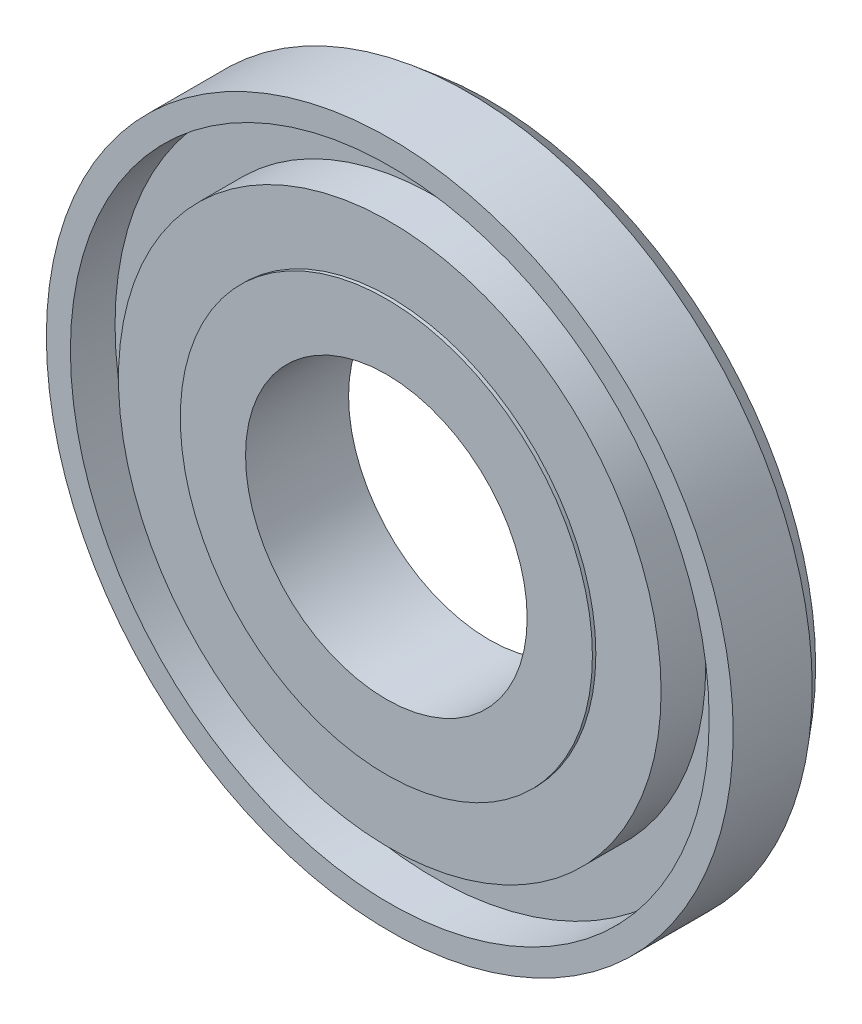
ISO-10303-21;
HEADER;
FILE_DESCRIPTION(('STEP AP214'),'2;1');
FILE_NAME('part.step','',(''),(''),'','','');
FILE_SCHEMA(('AUTOMOTIVE_DESIGN { 1 0 10303 214 1 1 1 1 }'));
ENDSEC;
DATA;
#1=APPLICATION_CONTEXT('core data for automotive mechanical design processes');
#2=APPLICATION_PROTOCOL_DEFINITION('international standard','automotive_design',2000,#1);
#3=PRODUCT_CONTEXT('',#1,'mechanical');
#4=PRODUCT('Part','Part','',(#3));
#5=PRODUCT_RELATED_PRODUCT_CATEGORY('part','',(#4));
#6=PRODUCT_DEFINITION_FORMATION('','',#4);
#7=PRODUCT_DEFINITION_CONTEXT('part definition',#1,'design');
#8=PRODUCT_DEFINITION('design','',#6,#7);
#9=PRODUCT_DEFINITION_SHAPE('','',#8);
#10=(LENGTH_UNIT() NAMED_UNIT(*) SI_UNIT(.MILLI.,.METRE.));
#11=(NAMED_UNIT(*) PLANE_ANGLE_UNIT() SI_UNIT($,.RADIAN.));
#12=(NAMED_UNIT(*) SI_UNIT($,.STERADIAN.) SOLID_ANGLE_UNIT());
#13=UNCERTAINTY_MEASURE_WITH_UNIT(LENGTH_MEASURE(1.E-05),#10,'distance_accuracy_value','');
#14=(GEOMETRIC_REPRESENTATION_CONTEXT(3) GLOBAL_UNCERTAINTY_ASSIGNED_CONTEXT((#13)) GLOBAL_UNIT_ASSIGNED_CONTEXT((#10,
#11,#12)) REPRESENTATION_CONTEXT('',''));
#15=CARTESIAN_POINT('',(0.,0.,0.));
#16=DIRECTION('',(0.,0.,1.));
#17=DIRECTION('',(1.,0.,0.));
#18=AXIS2_PLACEMENT_3D('',#15,#16,#17);
#19=CARTESIAN_POINT('',(2.77555756156289E-13,1.4432899320127E-12,0.));
#20=DIRECTION('',(0.,0.,1.));
#21=DIRECTION('',(1.,0.,0.));
#22=AXIS2_PLACEMENT_3D('',#19,#20,#21);
#23=CYLINDRICAL_SURFACE('',#22,39.5);
#24=CARTESIAN_POINT('',(6.66133814775094E-13,1.22124532708767E-12,7.99999999999368));
#25=DIRECTION('',(0.,0.,1.));
#26=DIRECTION('',(1.,0.,0.));
#27=AXIS2_PLACEMENT_3D('',#24,#25,#26);
#28=CIRCLE('',#27,39.5);
#29=CARTESIAN_POINT('',(39.5000000000007,1.40433498163617E-12,7.99999999999367));
#30=VERTEX_POINT('',#29);
#31=EDGE_CURVE('E91',#30,#30,#28,.T.);
#32=ORIENTED_EDGE('',*,*,#31,.T.);
#33=EDGE_LOOP('',(#32));
#34=FACE_BOUND('',#33,.T.);
#35=CARTESIAN_POINT('',(7.7715611723761E-13,1.33226762955019E-12,14.4999999999939));
#36=DIRECTION('',(0.,0.,1.));
#37=DIRECTION('',(1.,0.,0.));
#38=AXIS2_PLACEMENT_3D('',#35,#36,#37);
#39=CIRCLE('',#38,39.5);
#40=CARTESIAN_POINT('',(39.5000000000008,1.51535728409868E-12,14.4999999999938));
#41=VERTEX_POINT('',#40);
#42=EDGE_CURVE('E10',#41,#41,#39,.T.);
#43=ORIENTED_EDGE('',*,*,#42,.F.);
#44=EDGE_LOOP('',(#43));
#45=FACE_BOUND('',#44,.T.);
#46=ADVANCED_FACE('F40',(#34,#45),#23,.T.);
#47=CARTESIAN_POINT('',(30.0000000000006,7.7715611723761E-13,14.499999999997));
#48=DIRECTION('',(0.,0.,1.));
#49=DIRECTION('',(1.,0.,0.));
#50=AXIS2_PLACEMENT_3D('',#47,#48,#49);
#51=PLANE('',#50);
#52=ORIENTED_EDGE('',*,*,#42,.T.);
#53=EDGE_LOOP('',(#52));
#54=FACE_BOUND('',#53,.T.);
#55=CARTESIAN_POINT('',(7.7715611723761E-13,1.33226762955019E-12,14.4999999999939));
#56=DIRECTION('',(0.,0.,1.));
#57=DIRECTION('',(1.,0.,0.));
#58=AXIS2_PLACEMENT_3D('',#55,#56,#57);
#59=CIRCLE('',#58,30.);
#60=CARTESIAN_POINT('',(30.0000000000007,1.47132306338449E-12,14.4999999999938));
#61=VERTEX_POINT('',#60);
#62=EDGE_CURVE('E47',#61,#61,#59,.T.);
#63=ORIENTED_EDGE('',*,*,#62,.F.);
#64=EDGE_LOOP('',(#63));
#65=FACE_BOUND('',#64,.T.);
#66=ADVANCED_FACE('F112',(#54,#65),#51,.T.);
#67=CARTESIAN_POINT('',(2.77555756156289E-13,1.4432899320127E-12,0.));
#68=DIRECTION('',(0.,0.,1.));
#69=DIRECTION('',(1.,0.,0.));
#70=AXIS2_PLACEMENT_3D('',#67,#68,#69);
#71=CYLINDRICAL_SURFACE('',#70,29.9999999999999);
#72=ORIENTED_EDGE('',*,*,#62,.T.);
#73=EDGE_LOOP('',(#72));
#74=FACE_BOUND('',#73,.T.);
#75=CARTESIAN_POINT('',(6.10622663543836E-13,1.4432899320127E-12,14.999999999994));
#76=DIRECTION('',(0.,0.,1.));
#77=DIRECTION('',(1.,0.,0.));
#78=AXIS2_PLACEMENT_3D('',#75,#76,#77);
#79=CIRCLE('',#78,29.9999999999998);
#80=CARTESIAN_POINT('',(30.0000000000004,1.582345365847E-12,14.999999999994));
#81=VERTEX_POINT('',#80);
#82=EDGE_CURVE('E54',#81,#81,#79,.T.);
#83=ORIENTED_EDGE('',*,*,#82,.F.);
#84=EDGE_LOOP('',(#83));
#85=FACE_BOUND('',#84,.T.);
#86=ADVANCED_FACE('F116',(#74,#85),#71,.T.);
#87=CARTESIAN_POINT('',(20.5000000000001,1.77635683940025E-12,14.9999999999971));
#88=DIRECTION('',(0.,0.,1.));
#89=DIRECTION('',(1.,0.,0.));
#90=AXIS2_PLACEMENT_3D('',#87,#88,#89);
#91=PLANE('',#90);
#92=ORIENTED_EDGE('',*,*,#82,.T.);
#93=EDGE_LOOP('',(#92));
#94=FACE_BOUND('',#93,.T.);
#95=CARTESIAN_POINT('',(6.10622663543836E-13,1.4432899320127E-12,14.999999999994));
#96=DIRECTION('',(0.,0.,1.));
#97=DIRECTION('',(1.,0.,0.));
#98=AXIS2_PLACEMENT_3D('',#95,#96,#97);
#99=CIRCLE('',#98,20.4999999999998);
#100=CARTESIAN_POINT('',(20.5000000000004,1.53831114513281E-12,14.999999999994));
#101=VERTEX_POINT('',#100);
#102=EDGE_CURVE('E61',#101,#101,#99,.T.);
#103=ORIENTED_EDGE('',*,*,#102,.F.);
#104=EDGE_LOOP('',(#103));
#105=FACE_BOUND('',#104,.T.);
#106=ADVANCED_FACE('F120',(#94,#105),#91,.T.);
#107=CARTESIAN_POINT('',(2.77555756156289E-13,1.4432899320127E-12,0.));
#108=DIRECTION('',(0.,0.,1.));
#109=DIRECTION('',(1.,0.,0.));
#110=AXIS2_PLACEMENT_3D('',#107,#108,#109);
#111=CYLINDRICAL_SURFACE('',#110,20.4999999999998);
#112=ORIENTED_EDGE('',*,*,#102,.T.);
#113=EDGE_LOOP('',(#112));
#114=FACE_BOUND('',#113,.T.);
#115=CARTESIAN_POINT('',(2.77555756156289E-13,1.4432899320127E-12,0.));
#116=DIRECTION('',(0.,0.,1.));
#117=DIRECTION('',(1.,0.,0.));
#118=AXIS2_PLACEMENT_3D('',#115,#116,#117);
#119=CIRCLE('',#118,20.4999999999998);
#120=CARTESIAN_POINT('',(20.5000000000001,1.53831114513281E-12,0.));
#121=VERTEX_POINT('',#120);
#122=EDGE_CURVE('E67',#121,#121,#119,.T.);
#123=ORIENTED_EDGE('',*,*,#122,.F.);
#124=EDGE_LOOP('',(#123));
#125=FACE_BOUND('',#124,.T.);
#126=ADVANCED_FACE('F126',(#114,#125),#111,.F.);
#127=CARTESIAN_POINT('',(47.4999999999999,2.22044604925031E-13,0.));
#128=DIRECTION('',(0.,0.,-1.));
#129=DIRECTION('',(-1.,0.,0.));
#130=AXIS2_PLACEMENT_3D('',#127,#128,#129);
#131=PLANE('',#130);
#132=ORIENTED_EDGE('',*,*,#122,.T.);
#133=EDGE_LOOP('',(#132));
#134=FACE_BOUND('',#133,.T.);
#135=CARTESIAN_POINT('',(2.77555756156289E-13,1.4432899320127E-12,0.));
#136=DIRECTION('',(0.,0.,1.));
#137=DIRECTION('',(1.,0.,0.));
#138=AXIS2_PLACEMENT_3D('',#135,#136,#137);
#139=CIRCLE('',#138,47.4999999999998);
#140=CARTESIAN_POINT('',(47.5000000000001,1.66346103558368E-12,0.));
#141=VERTEX_POINT('',#140);
#142=EDGE_CURVE('E71',#141,#141,#139,.T.);
#143=ORIENTED_EDGE('',*,*,#142,.F.);
#144=EDGE_LOOP('',(#143));
#145=FACE_BOUND('',#144,.T.);
#146=ADVANCED_FACE('F130',(#134,#145),#131,.T.);
#147=CARTESIAN_POINT('',(6.66133814775094E-13,1.33226762955019E-12,3.00000000000045));
#148=DIRECTION('',(0.,0.,1.));
#149=DIRECTION('',(1.,0.,0.));
#150=AXIS2_PLACEMENT_3D('',#147,#148,#149);
#151=CONICAL_SURFACE('',#150,49.9999999999997,0.694738276196624);
#152=ORIENTED_EDGE('',*,*,#142,.T.);
#153=EDGE_LOOP('',(#152));
#154=FACE_BOUND('',#153,.T.);
#155=CARTESIAN_POINT('',(6.66133814775094E-13,1.33226762955019E-12,3.00000000000045));
#156=DIRECTION('',(0.,0.,1.));
#157=DIRECTION('',(1.,0.,0.));
#158=AXIS2_PLACEMENT_3D('',#155,#156,#157);
#159=CIRCLE('',#158,49.9999999999997);
#160=CARTESIAN_POINT('',(50.0000000000004,1.56402668594069E-12,3.00000000000044));
#161=VERTEX_POINT('',#160);
#162=EDGE_CURVE('E75',#161,#161,#159,.T.);
#163=ORIENTED_EDGE('',*,*,#162,.F.);
#164=EDGE_LOOP('',(#163));
#165=FACE_BOUND('',#164,.T.);
#166=ADVANCED_FACE('F134',(#154,#165),#151,.T.);
#167=CARTESIAN_POINT('',(2.77555756156289E-13,1.4432899320127E-12,0.));
#168=DIRECTION('',(0.,0.,1.));
#169=DIRECTION('',(1.,0.,0.));
#170=AXIS2_PLACEMENT_3D('',#167,#168,#169);
#171=CYLINDRICAL_SURFACE('',#170,49.9999999999999);
#172=ORIENTED_EDGE('',*,*,#162,.T.);
#173=EDGE_LOOP('',(#172));
#174=FACE_BOUND('',#173,.T.);
#175=CARTESIAN_POINT('',(7.7715611723761E-13,1.33226762955019E-12,14.4999999999939));
#176=DIRECTION('',(0.,0.,1.));
#177=DIRECTION('',(1.,0.,0.));
#178=AXIS2_PLACEMENT_3D('',#175,#176,#177);
#179=CIRCLE('',#178,50.);
#180=CARTESIAN_POINT('',(50.0000000000008,1.56402668594069E-12,14.4999999999938));
#181=VERTEX_POINT('',#180);
#182=EDGE_CURVE('E79',#181,#181,#179,.T.);
#183=ORIENTED_EDGE('',*,*,#182,.F.);
#184=EDGE_LOOP('',(#183));
#185=FACE_BOUND('',#184,.T.);
#186=ADVANCED_FACE('F138',(#174,#185),#171,.T.);
#187=CARTESIAN_POINT('',(46.5000000000003,1.77635683940025E-12,14.4999999999939));
#188=DIRECTION('',(0.,0.,1.));
#189=DIRECTION('',(1.,0.,0.));
#190=AXIS2_PLACEMENT_3D('',#187,#188,#189);
#191=PLANE('',#190);
#192=ORIENTED_EDGE('',*,*,#182,.T.);
#193=EDGE_LOOP('',(#192));
#194=FACE_BOUND('',#193,.T.);
#195=CARTESIAN_POINT('',(7.7715611723761E-13,1.33226762955019E-12,14.4999999999939));
#196=DIRECTION('',(0.,0.,1.));
#197=DIRECTION('',(1.,0.,0.));
#198=AXIS2_PLACEMENT_3D('',#195,#196,#197);
#199=CIRCLE('',#198,46.5);
#200=CARTESIAN_POINT('',(46.5000000000008,1.54780355199335E-12,14.4999999999938));
#201=VERTEX_POINT('',#200);
#202=EDGE_CURVE('E83',#201,#201,#199,.T.);
#203=ORIENTED_EDGE('',*,*,#202,.F.);
#204=EDGE_LOOP('',(#203));
#205=FACE_BOUND('',#204,.T.);
#206=ADVANCED_FACE('F108',(#194,#205),#191,.T.);
#207=CARTESIAN_POINT('',(2.77555756156289E-13,1.4432899320127E-12,0.));
#208=DIRECTION('',(0.,0.,1.));
#209=DIRECTION('',(1.,0.,0.));
#210=AXIS2_PLACEMENT_3D('',#207,#208,#209);
#211=CYLINDRICAL_SURFACE('',#210,46.5);
#212=ORIENTED_EDGE('',*,*,#202,.T.);
#213=EDGE_LOOP('',(#212));
#214=FACE_BOUND('',#213,.T.);
#215=CARTESIAN_POINT('',(6.66133814775094E-13,1.22124532708767E-12,7.99999999999368));
#216=DIRECTION('',(0.,0.,1.));
#217=DIRECTION('',(1.,0.,0.));
#218=AXIS2_PLACEMENT_3D('',#215,#216,#217);
#219=CIRCLE('',#218,46.5);
#220=CARTESIAN_POINT('',(46.5000000000007,1.43678124953084E-12,7.99999999999367));
#221=VERTEX_POINT('',#220);
#222=EDGE_CURVE('E87',#221,#221,#219,.T.);
#223=ORIENTED_EDGE('',*,*,#222,.F.);
#224=EDGE_LOOP('',(#223));
#225=FACE_BOUND('',#224,.T.);
#226=ADVANCED_FACE('F102',(#214,#225),#211,.F.);
#227=CARTESIAN_POINT('',(39.5000000000011,9.99200722162641E-13,7.99999999998946));
#228=DIRECTION('',(0.,0.,1.));
#229=DIRECTION('',(1.,0.,0.));
#230=AXIS2_PLACEMENT_3D('',#227,#228,#229);
#231=PLANE('',#230);
#232=ORIENTED_EDGE('',*,*,#222,.T.);
#233=EDGE_LOOP('',(#232));
#234=FACE_BOUND('',#233,.T.);
#235=ORIENTED_EDGE('',*,*,#31,.F.);
#236=EDGE_LOOP('',(#235));
#237=FACE_BOUND('',#236,.T.);
#238=ADVANCED_FACE('F100',(#234,#237),#231,.T.);
#239=CLOSED_SHELL('',(#46,#66,#86,#106,#126,#146,#166,#186,#206,#226,#238));
#240=MANIFOLD_SOLID_BREP('B2',#239);
#241=ADVANCED_BREP_SHAPE_REPRESENTATION('',(#18,#240),#14);
#242=SHAPE_DEFINITION_REPRESENTATION(#9,#241);
ENDSEC;
END-ISO-10303-21;
